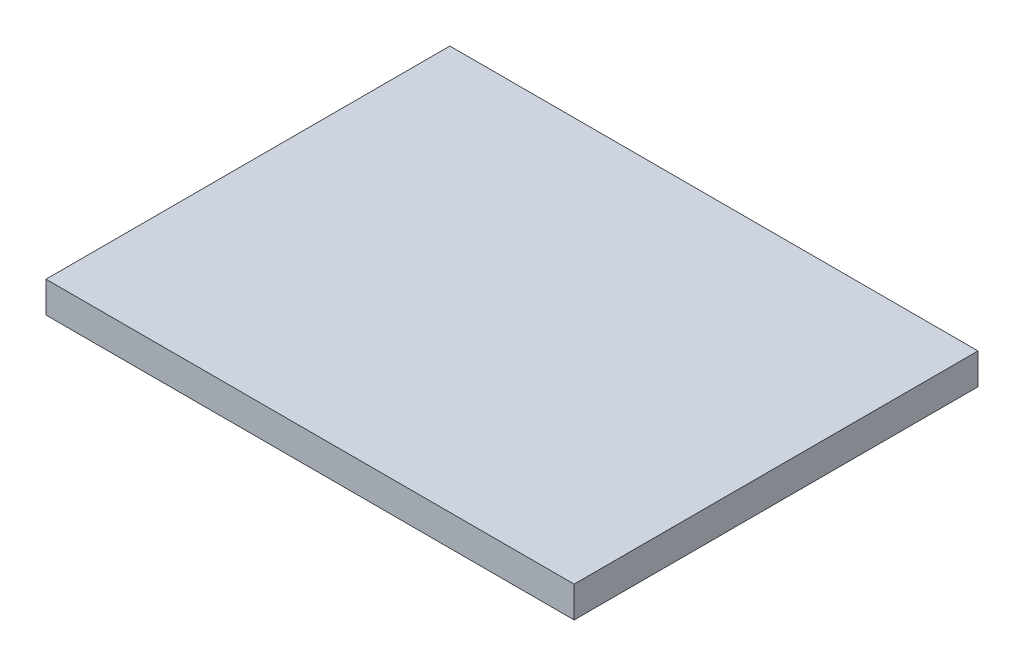
ISO-10303-21;
HEADER;
FILE_DESCRIPTION(('STEP AP214'),'2;1');
FILE_NAME('part.step','',(''),(''),'','','');
FILE_SCHEMA(('AUTOMOTIVE_DESIGN { 1 0 10303 214 1 1 1 1 }'));
ENDSEC;
DATA;
#1=APPLICATION_CONTEXT('core data for automotive mechanical design processes');
#2=APPLICATION_PROTOCOL_DEFINITION('international standard','automotive_design',2000,#1);
#3=PRODUCT_CONTEXT('',#1,'mechanical');
#4=PRODUCT('Part','Part','',(#3));
#5=PRODUCT_RELATED_PRODUCT_CATEGORY('part','',(#4));
#6=PRODUCT_DEFINITION_FORMATION('','',#4);
#7=PRODUCT_DEFINITION_CONTEXT('part definition',#1,'design');
#8=PRODUCT_DEFINITION('design','',#6,#7);
#9=PRODUCT_DEFINITION_SHAPE('','',#8);
#10=(LENGTH_UNIT() NAMED_UNIT(*) SI_UNIT(.MILLI.,.METRE.));
#11=(NAMED_UNIT(*) PLANE_ANGLE_UNIT() SI_UNIT($,.RADIAN.));
#12=(NAMED_UNIT(*) SI_UNIT($,.STERADIAN.) SOLID_ANGLE_UNIT());
#13=UNCERTAINTY_MEASURE_WITH_UNIT(LENGTH_MEASURE(1.E-05),#10,'distance_accuracy_value','');
#14=(GEOMETRIC_REPRESENTATION_CONTEXT(3) GLOBAL_UNCERTAINTY_ASSIGNED_CONTEXT((#13)) GLOBAL_UNIT_ASSIGNED_CONTEXT((#10,
#11,#12)) REPRESENTATION_CONTEXT('',''));
#15=CARTESIAN_POINT('',(0.,0.,0.));
#16=DIRECTION('',(0.,0.,1.));
#17=DIRECTION('',(1.,0.,0.));
#18=AXIS2_PLACEMENT_3D('',#15,#16,#17);
#19=CARTESIAN_POINT('',(-40.8625954198473,5.,-37.4885496183206));
#20=DIRECTION('',(1.,0.,0.));
#21=DIRECTION('',(0.,0.,-1.));
#22=AXIS2_PLACEMENT_3D('',#19,#20,#21);
#23=PLANE('',#22);
#24=DIRECTION('',(0.,0.,1.));
#25=VECTOR('',#24,1.);
#26=CARTESIAN_POINT('',(-40.8625954198473,0.,-37.4885496183206));
#27=LINE('',#26,#25);
#28=CARTESIAN_POINT('',(-40.8625954198473,0.,-37.4885496183206));
#29=VERTEX_POINT('',#28);
#30=CARTESIAN_POINT('',(-40.8625954198473,0.,27.5114503816794));
#31=VERTEX_POINT('',#30);
#32=EDGE_CURVE('E96',#29,#31,#27,.T.);
#33=ORIENTED_EDGE('',*,*,#32,.T.);
#34=DIRECTION('',(0.,-1.,0.));
#35=VECTOR('',#34,1.);
#36=CARTESIAN_POINT('',(-40.8625954198473,5.,27.5114503816794));
#37=LINE('',#36,#35);
#38=CARTESIAN_POINT('',(-40.8625954198473,5.,27.5114503816794));
#39=VERTEX_POINT('',#38);
#40=EDGE_CURVE('E11',#39,#31,#37,.T.);
#41=ORIENTED_EDGE('',*,*,#40,.F.);
#42=DIRECTION('',(0.,0.,1.));
#43=VECTOR('',#42,1.);
#44=CARTESIAN_POINT('',(-40.8625954198473,5.,-37.4885496183206));
#45=LINE('',#44,#43);
#46=CARTESIAN_POINT('',(-40.8625954198473,5.,-37.4885496183206));
#47=VERTEX_POINT('',#46);
#48=EDGE_CURVE('E84',#47,#39,#45,.T.);
#49=ORIENTED_EDGE('',*,*,#48,.F.);
#50=DIRECTION('',(0.,-1.,0.));
#51=VECTOR('',#50,1.);
#52=CARTESIAN_POINT('',(-40.8625954198473,5.,-37.4885496183206));
#53=LINE('',#52,#51);
#54=EDGE_CURVE('E92',#47,#29,#53,.T.);
#55=ORIENTED_EDGE('',*,*,#54,.T.);
#56=EDGE_LOOP('',(#33,#41,#49,#55));
#57=FACE_BOUND('',#56,.T.);
#58=ADVANCED_FACE('F33',(#57),#23,.F.);
#59=CARTESIAN_POINT('',(-40.8625954198473,5.,27.5114503816794));
#60=DIRECTION('',(0.,0.,-1.));
#61=DIRECTION('',(-1.,0.,0.));
#62=AXIS2_PLACEMENT_3D('',#59,#60,#61);
#63=PLANE('',#62);
#64=DIRECTION('',(1.,0.,0.));
#65=VECTOR('',#64,1.);
#66=CARTESIAN_POINT('',(-40.8625954198473,0.,27.5114503816794));
#67=LINE('',#66,#65);
#68=CARTESIAN_POINT('',(44.1374045801527,0.,27.5114503816794));
#69=VERTEX_POINT('',#68);
#70=EDGE_CURVE('E88',#31,#69,#67,.T.);
#71=ORIENTED_EDGE('',*,*,#70,.T.);
#72=DIRECTION('',(0.,-1.,0.));
#73=VECTOR('',#72,1.);
#74=CARTESIAN_POINT('',(44.1374045801527,5.,27.5114503816794));
#75=LINE('',#74,#73);
#76=CARTESIAN_POINT('',(44.1374045801527,5.,27.5114503816794));
#77=VERTEX_POINT('',#76);
#78=EDGE_CURVE('E41',#77,#69,#75,.T.);
#79=ORIENTED_EDGE('',*,*,#78,.F.);
#80=DIRECTION('',(1.,0.,0.));
#81=VECTOR('',#80,1.);
#82=CARTESIAN_POINT('',(-40.8625954198473,5.,27.5114503816794));
#83=LINE('',#82,#81);
#84=EDGE_CURVE('E79',#39,#77,#83,.T.);
#85=ORIENTED_EDGE('',*,*,#84,.F.);
#86=ORIENTED_EDGE('',*,*,#40,.T.);
#87=EDGE_LOOP('',(#71,#79,#85,#86));
#88=FACE_BOUND('',#87,.T.);
#89=ADVANCED_FACE('F87',(#88),#63,.F.);
#90=CARTESIAN_POINT('',(44.1374045801527,5.,-37.4885496183206));
#91=DIRECTION('',(-1.,0.,0.));
#92=DIRECTION('',(0.,0.,1.));
#93=AXIS2_PLACEMENT_3D('',#90,#91,#92);
#94=PLANE('',#93);
#95=DIRECTION('',(0.,0.,-1.));
#96=VECTOR('',#95,1.);
#97=CARTESIAN_POINT('',(44.1374045801527,0.,-37.4885496183206));
#98=LINE('',#97,#96);
#99=CARTESIAN_POINT('',(44.1374045801527,0.,-37.4885496183206));
#100=VERTEX_POINT('',#99);
#101=EDGE_CURVE('E66',#69,#100,#98,.T.);
#102=ORIENTED_EDGE('',*,*,#101,.T.);
#103=DIRECTION('',(0.,-1.,0.));
#104=VECTOR('',#103,1.);
#105=CARTESIAN_POINT('',(44.1374045801527,5.,-37.4885496183206));
#106=LINE('',#105,#104);
#107=CARTESIAN_POINT('',(44.1374045801527,5.,-37.4885496183206));
#108=VERTEX_POINT('',#107);
#109=EDGE_CURVE('E89',#108,#100,#106,.T.);
#110=ORIENTED_EDGE('',*,*,#109,.F.);
#111=DIRECTION('',(0.,0.,-1.));
#112=VECTOR('',#111,1.);
#113=CARTESIAN_POINT('',(44.1374045801527,5.,-37.4885496183206));
#114=LINE('',#113,#112);
#115=EDGE_CURVE('E82',#77,#108,#114,.T.);
#116=ORIENTED_EDGE('',*,*,#115,.F.);
#117=ORIENTED_EDGE('',*,*,#78,.T.);
#118=EDGE_LOOP('',(#102,#110,#116,#117));
#119=FACE_BOUND('',#118,.T.);
#120=ADVANCED_FACE('F90',(#119),#94,.F.);
#121=CARTESIAN_POINT('',(-40.8625954198473,5.,-37.4885496183206));
#122=DIRECTION('',(0.,0.,1.));
#123=DIRECTION('',(1.,0.,0.));
#124=AXIS2_PLACEMENT_3D('',#121,#122,#123);
#125=PLANE('',#124);
#126=DIRECTION('',(-1.,0.,0.));
#127=VECTOR('',#126,1.);
#128=CARTESIAN_POINT('',(-40.8625954198473,0.,-37.4885496183206));
#129=LINE('',#128,#127);
#130=EDGE_CURVE('E72',#100,#29,#129,.T.);
#131=ORIENTED_EDGE('',*,*,#130,.T.);
#132=ORIENTED_EDGE('',*,*,#54,.F.);
#133=DIRECTION('',(-1.,0.,0.));
#134=VECTOR('',#133,1.);
#135=CARTESIAN_POINT('',(-40.8625954198473,5.,-37.4885496183206));
#136=LINE('',#135,#134);
#137=EDGE_CURVE('E49',#108,#47,#136,.T.);
#138=ORIENTED_EDGE('',*,*,#137,.F.);
#139=ORIENTED_EDGE('',*,*,#109,.T.);
#140=EDGE_LOOP('',(#131,#132,#138,#139));
#141=FACE_BOUND('',#140,.T.);
#142=ADVANCED_FACE('F103',(#141),#125,.F.);
#143=CARTESIAN_POINT('',(0.,5.,0.));
#144=DIRECTION('',(0.,1.,0.));
#145=DIRECTION('',(0.,0.,1.));
#146=AXIS2_PLACEMENT_3D('',#143,#144,#145);
#147=PLANE('',#146);
#148=ORIENTED_EDGE('',*,*,#48,.T.);
#149=ORIENTED_EDGE('',*,*,#84,.T.);
#150=ORIENTED_EDGE('',*,*,#115,.T.);
#151=ORIENTED_EDGE('',*,*,#137,.T.);
#152=EDGE_LOOP('',(#148,#149,#150,#151));
#153=FACE_BOUND('',#152,.T.);
#154=ADVANCED_FACE('F80',(#153),#147,.T.);
#155=CARTESIAN_POINT('',(0.,0.,0.));
#156=DIRECTION('',(0.,1.,0.));
#157=DIRECTION('',(0.,0.,1.));
#158=AXIS2_PLACEMENT_3D('',#155,#156,#157);
#159=PLANE('',#158);
#160=ORIENTED_EDGE('',*,*,#32,.F.);
#161=ORIENTED_EDGE('',*,*,#130,.F.);
#162=ORIENTED_EDGE('',*,*,#101,.F.);
#163=ORIENTED_EDGE('',*,*,#70,.F.);
#164=EDGE_LOOP('',(#160,#161,#162,#163));
#165=FACE_BOUND('',#164,.T.);
#166=ADVANCED_FACE('F106',(#165),#159,.F.);
#167=CLOSED_SHELL('',(#58,#89,#120,#142,#154,#166));
#168=MANIFOLD_SOLID_BREP('B2',#167);
#169=ADVANCED_BREP_SHAPE_REPRESENTATION('',(#18,#168),#14);
#170=SHAPE_DEFINITION_REPRESENTATION(#9,#169);
ENDSEC;
END-ISO-10303-21;
